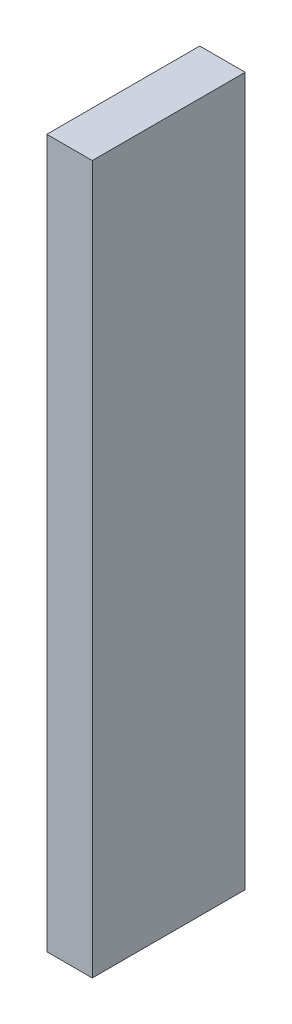
ISO-10303-21;
HEADER;
FILE_DESCRIPTION(('STEP AP214'),'2;1');
FILE_NAME('part.step','',(''),(''),'','','');
FILE_SCHEMA(('AUTOMOTIVE_DESIGN { 1 0 10303 214 1 1 1 1 }'));
ENDSEC;
DATA;
#1=APPLICATION_CONTEXT('core data for automotive mechanical design processes');
#2=APPLICATION_PROTOCOL_DEFINITION('international standard','automotive_design',2000,#1);
#3=PRODUCT_CONTEXT('',#1,'mechanical');
#4=PRODUCT('Part','Part','',(#3));
#5=PRODUCT_RELATED_PRODUCT_CATEGORY('part','',(#4));
#6=PRODUCT_DEFINITION_FORMATION('','',#4);
#7=PRODUCT_DEFINITION_CONTEXT('part definition',#1,'design');
#8=PRODUCT_DEFINITION('design','',#6,#7);
#9=PRODUCT_DEFINITION_SHAPE('','',#8);
#10=(LENGTH_UNIT() NAMED_UNIT(*) SI_UNIT(.MILLI.,.METRE.));
#11=(NAMED_UNIT(*) PLANE_ANGLE_UNIT() SI_UNIT($,.RADIAN.));
#12=(NAMED_UNIT(*) SI_UNIT($,.STERADIAN.) SOLID_ANGLE_UNIT());
#13=UNCERTAINTY_MEASURE_WITH_UNIT(LENGTH_MEASURE(1.E-05),#10,'distance_accuracy_value','');
#14=(GEOMETRIC_REPRESENTATION_CONTEXT(3) GLOBAL_UNCERTAINTY_ASSIGNED_CONTEXT((#13)) GLOBAL_UNIT_ASSIGNED_CONTEXT((#10,
#11,#12)) REPRESENTATION_CONTEXT('',''));
#15=CARTESIAN_POINT('',(0.,0.,0.));
#16=DIRECTION('',(0.,0.,1.));
#17=DIRECTION('',(1.,0.,0.));
#18=AXIS2_PLACEMENT_3D('',#15,#16,#17);
#19=CARTESIAN_POINT('',(130.275545136319,22.4180708263693,131.072028202897));
#20=DIRECTION('',(-1.69244514382854E-09,0.,1.));
#21=DIRECTION('',(1.,0.,1.69244514382854E-09));
#22=AXIS2_PLACEMENT_3D('',#19,#20,#21);
#23=PLANE('',#22);
#24=DIRECTION('',(0.,-1.,0.));
#25=VECTOR('',#24,1.);
#26=CARTESIAN_POINT('',(131.258630233332,22.4180708263693,131.072028204561));
#27=LINE('',#26,#25);
#28=CARTESIAN_POINT('',(131.258630233332,22.4180708263693,131.072028204561));
#29=VERTEX_POINT('',#28);
#30=CARTESIAN_POINT('',(131.258630233332,7.11212965552235,131.072028204561));
#31=VERTEX_POINT('',#30);
#32=EDGE_CURVE('E79',#29,#31,#27,.T.);
#33=ORIENTED_EDGE('',*,*,#32,.F.);
#34=DIRECTION('',(1.,0.,1.69244514382854E-09));
#35=VECTOR('',#34,1.);
#36=CARTESIAN_POINT('',(130.275545136319,22.4180708263693,131.072028202897));
#37=LINE('',#36,#35);
#38=CARTESIAN_POINT('',(130.275545136319,22.4180708263693,131.072028202897));
#39=VERTEX_POINT('',#38);
#40=EDGE_CURVE('E32',#39,#29,#37,.T.);
#41=ORIENTED_EDGE('',*,*,#40,.F.);
#42=DIRECTION('',(0.,-1.,0.));
#43=VECTOR('',#42,1.);
#44=CARTESIAN_POINT('',(130.275545136319,22.4180708263693,131.072028202897));
#45=LINE('',#44,#43);
#46=CARTESIAN_POINT('',(130.275545136319,7.11212965552235,131.072028202897));
#47=VERTEX_POINT('',#46);
#48=EDGE_CURVE('E71',#39,#47,#45,.T.);
#49=ORIENTED_EDGE('',*,*,#48,.T.);
#50=DIRECTION('',(1.,0.,1.69244514382854E-09));
#51=VECTOR('',#50,1.);
#52=CARTESIAN_POINT('',(130.275545136319,7.11212965552235,131.072028202897));
#53=LINE('',#52,#51);
#54=EDGE_CURVE('E10',#47,#31,#53,.T.);
#55=ORIENTED_EDGE('',*,*,#54,.T.);
#56=EDGE_LOOP('',(#33,#41,#49,#55));
#57=FACE_BOUND('',#56,.T.);
#58=ADVANCED_FACE('F16',(#57),#23,.T.);
#59=CARTESIAN_POINT('',(130.275545136319,7.11212965552235,131.072028202897));
#60=DIRECTION('',(0.,-1.,0.));
#61=DIRECTION('',(0.,0.,-1.));
#62=AXIS2_PLACEMENT_3D('',#59,#60,#61);
#63=PLANE('',#62);
#64=DIRECTION('',(1.69244514382854E-09,0.,-1.));
#65=VECTOR('',#64,1.);
#66=CARTESIAN_POINT('',(131.258630233332,7.11212965552235,131.072028204561));
#67=LINE('',#66,#65);
#68=CARTESIAN_POINT('',(131.258630238927,7.11212965552235,127.766087033712));
#69=VERTEX_POINT('',#68);
#70=EDGE_CURVE('E82',#31,#69,#67,.T.);
#71=ORIENTED_EDGE('',*,*,#70,.F.);
#72=ORIENTED_EDGE('',*,*,#54,.F.);
#73=DIRECTION('',(1.69244514382854E-09,0.,-1.));
#74=VECTOR('',#73,1.);
#75=CARTESIAN_POINT('',(130.275545136319,7.11212965552235,131.072028202897));
#76=LINE('',#75,#74);
#77=CARTESIAN_POINT('',(130.275545141914,7.11212965552235,127.766087032048));
#78=VERTEX_POINT('',#77);
#79=EDGE_CURVE('E67',#47,#78,#76,.T.);
#80=ORIENTED_EDGE('',*,*,#79,.T.);
#81=DIRECTION('',(1.,0.,1.69244514382854E-09));
#82=VECTOR('',#81,1.);
#83=CARTESIAN_POINT('',(130.275545141914,7.11212965552235,127.766087032048));
#84=LINE('',#83,#82);
#85=EDGE_CURVE('E24',#78,#69,#84,.T.);
#86=ORIENTED_EDGE('',*,*,#85,.T.);
#87=EDGE_LOOP('',(#71,#72,#80,#86));
#88=FACE_BOUND('',#87,.T.);
#89=ADVANCED_FACE('F68',(#88),#63,.T.);
#90=CARTESIAN_POINT('',(130.275545141914,7.11212965552235,127.766087032048));
#91=DIRECTION('',(1.69244514382854E-09,0.,-1.));
#92=DIRECTION('',(-1.,0.,-1.69244514382854E-09));
#93=AXIS2_PLACEMENT_3D('',#90,#91,#92);
#94=PLANE('',#93);
#95=DIRECTION('',(0.,1.,0.));
#96=VECTOR('',#95,1.);
#97=CARTESIAN_POINT('',(131.258630238927,7.11212965552235,127.766087033712));
#98=LINE('',#97,#96);
#99=CARTESIAN_POINT('',(131.258630238927,22.418070826371,127.766087025251));
#100=VERTEX_POINT('',#99);
#101=EDGE_CURVE('E65',#69,#100,#98,.T.);
#102=ORIENTED_EDGE('',*,*,#101,.F.);
#103=ORIENTED_EDGE('',*,*,#85,.F.);
#104=DIRECTION('',(0.,1.,0.));
#105=VECTOR('',#104,1.);
#106=CARTESIAN_POINT('',(130.275545141914,7.11212965552235,127.766087032048));
#107=LINE('',#106,#105);
#108=CARTESIAN_POINT('',(130.275545141914,22.418070826371,127.766087023588));
#109=VERTEX_POINT('',#108);
#110=EDGE_CURVE('E62',#78,#109,#107,.T.);
#111=ORIENTED_EDGE('',*,*,#110,.T.);
#112=DIRECTION('',(1.,0.,1.69244514382854E-09));
#113=VECTOR('',#112,1.);
#114=CARTESIAN_POINT('',(130.275545141914,22.418070826371,127.766087023588));
#115=LINE('',#114,#113);
#116=EDGE_CURVE('E48',#109,#100,#115,.T.);
#117=ORIENTED_EDGE('',*,*,#116,.T.);
#118=EDGE_LOOP('',(#102,#103,#111,#117));
#119=FACE_BOUND('',#118,.T.);
#120=ADVANCED_FACE('F60',(#119),#94,.T.);
#121=CARTESIAN_POINT('',(130.275545141914,22.418070826371,127.766087023588));
#122=DIRECTION('',(0.,1.,0.));
#123=DIRECTION('',(-1.,0.,0.));
#124=AXIS2_PLACEMENT_3D('',#121,#122,#123);
#125=PLANE('',#124);
#126=DIRECTION('',(-1.69244514382854E-09,0.,1.));
#127=VECTOR('',#126,1.);
#128=CARTESIAN_POINT('',(131.258630238927,22.418070826371,127.766087025251));
#129=LINE('',#128,#127);
#130=EDGE_CURVE('E85',#100,#29,#129,.T.);
#131=ORIENTED_EDGE('',*,*,#130,.F.);
#132=ORIENTED_EDGE('',*,*,#116,.F.);
#133=DIRECTION('',(-1.69244514382854E-09,0.,1.));
#134=VECTOR('',#133,1.);
#135=CARTESIAN_POINT('',(130.275545141914,22.418070826371,127.766087023588));
#136=LINE('',#135,#134);
#137=EDGE_CURVE('E74',#109,#39,#136,.T.);
#138=ORIENTED_EDGE('',*,*,#137,.T.);
#139=ORIENTED_EDGE('',*,*,#40,.T.);
#140=EDGE_LOOP('',(#131,#132,#138,#139));
#141=FACE_BOUND('',#140,.T.);
#142=ADVANCED_FACE('F96',(#141),#125,.T.);
#143=CARTESIAN_POINT('',(130.275545201028,17.2651002409467,92.8378644340291));
#144=DIRECTION('',(1.,0.,1.69244514382854E-09));
#145=DIRECTION('',(0.,1.,0.));
#146=AXIS2_PLACEMENT_3D('',#143,#144,#145);
#147=PLANE('',#146);
#148=ORIENTED_EDGE('',*,*,#48,.F.);
#149=ORIENTED_EDGE('',*,*,#137,.F.);
#150=ORIENTED_EDGE('',*,*,#110,.F.);
#151=ORIENTED_EDGE('',*,*,#79,.F.);
#152=EDGE_LOOP('',(#148,#149,#150,#151));
#153=FACE_BOUND('',#152,.T.);
#154=ADVANCED_FACE('F73',(#153),#147,.F.);
#155=CARTESIAN_POINT('',(131.258630298041,17.2651002409467,92.8378644356929));
#156=DIRECTION('',(1.,0.,1.69244514382854E-09));
#157=DIRECTION('',(0.,1.,0.));
#158=AXIS2_PLACEMENT_3D('',#155,#156,#157);
#159=PLANE('',#158);
#160=ORIENTED_EDGE('',*,*,#32,.T.);
#161=ORIENTED_EDGE('',*,*,#70,.T.);
#162=ORIENTED_EDGE('',*,*,#101,.T.);
#163=ORIENTED_EDGE('',*,*,#130,.T.);
#164=EDGE_LOOP('',(#160,#161,#162,#163));
#165=FACE_BOUND('',#164,.T.);
#166=ADVANCED_FACE('F89',(#165),#159,.T.);
#167=CLOSED_SHELL('',(#58,#89,#120,#142,#154,#166));
#168=MANIFOLD_SOLID_BREP('B1',#167);
#169=ADVANCED_BREP_SHAPE_REPRESENTATION('',(#18,#168),#14);
#170=SHAPE_DEFINITION_REPRESENTATION(#9,#169);
ENDSEC;
END-ISO-10303-21;
